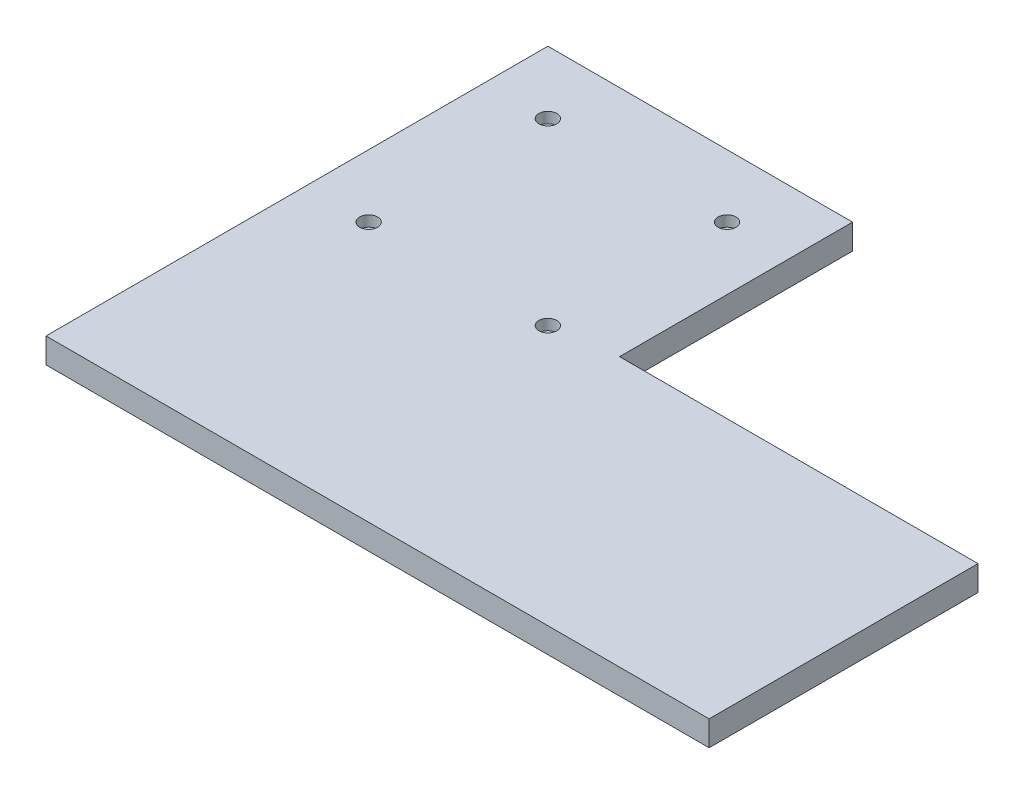
ISO-10303-21;
HEADER;
FILE_DESCRIPTION(('STEP AP214'),'2;1');
FILE_NAME('part.step','',(''),(''),'','','');
FILE_SCHEMA(('AUTOMOTIVE_DESIGN { 1 0 10303 214 1 1 1 1 }'));
ENDSEC;
DATA;
#1=APPLICATION_CONTEXT('core data for automotive mechanical design processes');
#2=APPLICATION_PROTOCOL_DEFINITION('international standard','automotive_design',2000,#1);
#3=PRODUCT_CONTEXT('',#1,'mechanical');
#4=PRODUCT('Part','Part','',(#3));
#5=PRODUCT_RELATED_PRODUCT_CATEGORY('part','',(#4));
#6=PRODUCT_DEFINITION_FORMATION('','',#4);
#7=PRODUCT_DEFINITION_CONTEXT('part definition',#1,'design');
#8=PRODUCT_DEFINITION('design','',#6,#7);
#9=PRODUCT_DEFINITION_SHAPE('','',#8);
#10=(LENGTH_UNIT() NAMED_UNIT(*) SI_UNIT(.MILLI.,.METRE.));
#11=(NAMED_UNIT(*) PLANE_ANGLE_UNIT() SI_UNIT($,.RADIAN.));
#12=(NAMED_UNIT(*) SI_UNIT($,.STERADIAN.) SOLID_ANGLE_UNIT());
#13=UNCERTAINTY_MEASURE_WITH_UNIT(LENGTH_MEASURE(1.E-05),#10,'distance_accuracy_value','');
#14=(GEOMETRIC_REPRESENTATION_CONTEXT(3) GLOBAL_UNCERTAINTY_ASSIGNED_CONTEXT((#13)) GLOBAL_UNIT_ASSIGNED_CONTEXT((#10,
#11,#12)) REPRESENTATION_CONTEXT('',''));
#15=CARTESIAN_POINT('',(0.,0.,0.));
#16=DIRECTION('',(0.,0.,1.));
#17=DIRECTION('',(1.,0.,0.));
#18=AXIS2_PLACEMENT_3D('',#15,#16,#17);
#19=CARTESIAN_POINT('',(0.,7.,0.));
#20=DIRECTION('',(0.,-1.,0.));
#21=DIRECTION('',(0.,0.,-1.));
#22=AXIS2_PLACEMENT_3D('',#19,#20,#21);
#23=PLANE('',#22);
#24=CARTESIAN_POINT('',(-3.18170640313416,7.,-14.3949044585987));
#25=DIRECTION('',(0.,1.,0.));
#26=DIRECTION('',(0.,0.,1.));
#27=AXIS2_PLACEMENT_3D('',#24,#25,#26);
#28=CIRCLE('',#27,2.49999999999999);
#29=CARTESIAN_POINT('',(-3.18170640313416,7.,-11.8949044585987));
#30=VERTEX_POINT('',#29);
#31=EDGE_CURVE('E239',#30,#30,#28,.T.);
#32=ORIENTED_EDGE('',*,*,#31,.F.);
#33=EDGE_LOOP('',(#32));
#34=FACE_BOUND('',#33,.T.);
#35=CARTESIAN_POINT('',(-53.1817064031342,7.,-14.3949044585987));
#36=DIRECTION('',(0.,1.,0.));
#37=DIRECTION('',(0.,0.,1.));
#38=AXIS2_PLACEMENT_3D('',#35,#36,#37);
#39=CIRCLE('',#38,2.49999999999999);
#40=CARTESIAN_POINT('',(-53.1817064031342,7.,-11.8949044585987));
#41=VERTEX_POINT('',#40);
#42=EDGE_CURVE('E223',#41,#41,#39,.T.);
#43=ORIENTED_EDGE('',*,*,#42,.F.);
#44=EDGE_LOOP('',(#43));
#45=FACE_BOUND('',#44,.T.);
#46=DIRECTION('',(-1.,0.,0.));
#47=VECTOR('',#46,1.);
#48=CARTESIAN_POINT('',(114.318293596866,7.,33.1050955414013));
#49=LINE('',#48,#47);
#50=CARTESIAN_POINT('',(114.318293596866,7.,33.1050955414013));
#51=VERTEX_POINT('',#50);
#52=CARTESIAN_POINT('',(14.3182935968658,7.,33.1050955414013));
#53=VERTEX_POINT('',#52);
#54=EDGE_CURVE('E146',#51,#53,#49,.T.);
#55=ORIENTED_EDGE('',*,*,#54,.T.);
#56=DIRECTION('',(0.,0.,-1.));
#57=VECTOR('',#56,1.);
#58=CARTESIAN_POINT('',(14.3182935968658,7.,33.1050955414013));
#59=LINE('',#58,#57);
#60=CARTESIAN_POINT('',(14.3182935968658,7.,-31.8949044585987));
#61=VERTEX_POINT('',#60);
#62=EDGE_CURVE('E94',#53,#61,#59,.T.);
#63=ORIENTED_EDGE('',*,*,#62,.T.);
#64=DIRECTION('',(-1.,0.,0.));
#65=VECTOR('',#64,1.);
#66=CARTESIAN_POINT('',(14.3182935968658,7.,-31.8949044585987));
#67=LINE('',#66,#65);
#68=CARTESIAN_POINT('',(-70.6817064031342,7.,-31.8949044585987));
#69=VERTEX_POINT('',#68);
#70=EDGE_CURVE('E107',#61,#69,#67,.T.);
#71=ORIENTED_EDGE('',*,*,#70,.T.);
#72=DIRECTION('',(0.,0.,1.));
#73=VECTOR('',#72,1.);
#74=CARTESIAN_POINT('',(-70.6817064031342,7.,-31.8949044585987));
#75=LINE('',#74,#73);
#76=CARTESIAN_POINT('',(-70.6817064031341,7.,108.105095541401));
#77=VERTEX_POINT('',#76);
#78=EDGE_CURVE('E101',#69,#77,#75,.T.);
#79=ORIENTED_EDGE('',*,*,#78,.T.);
#80=DIRECTION('',(1.,0.,0.));
#81=VECTOR('',#80,1.);
#82=CARTESIAN_POINT('',(-70.6817064031341,7.,108.105095541401));
#83=LINE('',#82,#81);
#84=CARTESIAN_POINT('',(114.318293596866,7.,108.105095541401));
#85=VERTEX_POINT('',#84);
#86=EDGE_CURVE('E105',#77,#85,#83,.T.);
#87=ORIENTED_EDGE('',*,*,#86,.T.);
#88=DIRECTION('',(0.,0.,-1.));
#89=VECTOR('',#88,1.);
#90=CARTESIAN_POINT('',(114.318293596866,7.,108.105095541401));
#91=LINE('',#90,#89);
#92=EDGE_CURVE('E57',#85,#51,#91,.T.);
#93=ORIENTED_EDGE('',*,*,#92,.T.);
#94=EDGE_LOOP('',(#55,#63,#71,#79,#87,#93));
#95=FACE_BOUND('',#94,.T.);
#96=CARTESIAN_POINT('',(-3.18170640313416,7.,35.6050955414013));
#97=DIRECTION('',(0.,-1.,0.));
#98=DIRECTION('',(0.,0.,-1.));
#99=AXIS2_PLACEMENT_3D('',#96,#97,#98);
#100=CIRCLE('',#99,2.49999999999999);
#101=CARTESIAN_POINT('',(-3.18170640313416,7.,33.1050955414013));
#102=VERTEX_POINT('',#101);
#103=EDGE_CURVE('E221',#102,#102,#100,.T.);
#104=ORIENTED_EDGE('',*,*,#103,.T.);
#105=EDGE_LOOP('',(#104));
#106=FACE_BOUND('',#105,.T.);
#107=CARTESIAN_POINT('',(-53.1817064031342,7.,35.6050955414013));
#108=DIRECTION('',(0.,-1.,0.));
#109=DIRECTION('',(0.,0.,-1.));
#110=AXIS2_PLACEMENT_3D('',#107,#108,#109);
#111=CIRCLE('',#110,2.49999999999999);
#112=CARTESIAN_POINT('',(-53.1817064031342,7.,33.1050955414013));
#113=VERTEX_POINT('',#112);
#114=EDGE_CURVE('E229',#113,#113,#111,.T.);
#115=ORIENTED_EDGE('',*,*,#114,.T.);
#116=EDGE_LOOP('',(#115));
#117=FACE_BOUND('',#116,.T.);
#118=ADVANCED_FACE('F39',(#34,#45,#95,#106,#117),#23,.F.);
#119=CARTESIAN_POINT('',(114.318293596866,7.,33.1050955414013));
#120=DIRECTION('',(0.,0.,1.));
#121=DIRECTION('',(1.,0.,0.));
#122=AXIS2_PLACEMENT_3D('',#119,#120,#121);
#123=PLANE('',#122);
#124=DIRECTION('',(-1.,0.,0.));
#125=VECTOR('',#124,1.);
#126=CARTESIAN_POINT('',(114.318293596866,0.,33.1050955414013));
#127=LINE('',#126,#125);
#128=CARTESIAN_POINT('',(114.318293596866,0.,33.1050955414013));
#129=VERTEX_POINT('',#128);
#130=CARTESIAN_POINT('',(14.3182935968658,0.,33.1050955414013));
#131=VERTEX_POINT('',#130);
#132=EDGE_CURVE('E129',#129,#131,#127,.T.);
#133=ORIENTED_EDGE('',*,*,#132,.T.);
#134=DIRECTION('',(0.,-1.,0.));
#135=VECTOR('',#134,1.);
#136=CARTESIAN_POINT('',(14.3182935968658,7.,33.1050955414013));
#137=LINE('',#136,#135);
#138=EDGE_CURVE('E11',#53,#131,#137,.T.);
#139=ORIENTED_EDGE('',*,*,#138,.F.);
#140=ORIENTED_EDGE('',*,*,#54,.F.);
#141=DIRECTION('',(0.,-1.,0.));
#142=VECTOR('',#141,1.);
#143=CARTESIAN_POINT('',(114.318293596866,7.,33.1050955414013));
#144=LINE('',#143,#142);
#145=EDGE_CURVE('E125',#51,#129,#144,.T.);
#146=ORIENTED_EDGE('',*,*,#145,.T.);
#147=EDGE_LOOP('',(#133,#139,#140,#146));
#148=FACE_BOUND('',#147,.T.);
#149=ADVANCED_FACE('F41',(#148),#123,.F.);
#150=CARTESIAN_POINT('',(14.3182935968658,7.,33.1050955414013));
#151=DIRECTION('',(-1.,0.,0.));
#152=DIRECTION('',(0.,0.,1.));
#153=AXIS2_PLACEMENT_3D('',#150,#151,#152);
#154=PLANE('',#153);
#155=DIRECTION('',(0.,0.,-1.));
#156=VECTOR('',#155,1.);
#157=CARTESIAN_POINT('',(14.3182935968658,0.,33.1050955414013));
#158=LINE('',#157,#156);
#159=CARTESIAN_POINT('',(14.3182935968658,0.,-31.8949044585987));
#160=VERTEX_POINT('',#159);
#161=EDGE_CURVE('E133',#131,#160,#158,.T.);
#162=ORIENTED_EDGE('',*,*,#161,.T.);
#163=DIRECTION('',(0.,-1.,0.));
#164=VECTOR('',#163,1.);
#165=CARTESIAN_POINT('',(14.3182935968658,7.,-31.8949044585987));
#166=LINE('',#165,#164);
#167=EDGE_CURVE('E49',#61,#160,#166,.T.);
#168=ORIENTED_EDGE('',*,*,#167,.F.);
#169=ORIENTED_EDGE('',*,*,#62,.F.);
#170=ORIENTED_EDGE('',*,*,#138,.T.);
#171=EDGE_LOOP('',(#162,#168,#169,#170));
#172=FACE_BOUND('',#171,.T.);
#173=ADVANCED_FACE('F179',(#172),#154,.F.);
#174=CARTESIAN_POINT('',(14.3182935968658,7.,-31.8949044585987));
#175=DIRECTION('',(0.,0.,1.));
#176=DIRECTION('',(1.,0.,0.));
#177=AXIS2_PLACEMENT_3D('',#174,#175,#176);
#178=PLANE('',#177);
#179=DIRECTION('',(-1.,0.,0.));
#180=VECTOR('',#179,1.);
#181=CARTESIAN_POINT('',(14.3182935968658,0.,-31.8949044585987));
#182=LINE('',#181,#180);
#183=CARTESIAN_POINT('',(-70.6817064031342,0.,-31.8949044585987));
#184=VERTEX_POINT('',#183);
#185=EDGE_CURVE('E137',#160,#184,#182,.T.);
#186=ORIENTED_EDGE('',*,*,#185,.T.);
#187=DIRECTION('',(0.,-1.,0.));
#188=VECTOR('',#187,1.);
#189=CARTESIAN_POINT('',(-70.6817064031342,7.,-31.8949044585987));
#190=LINE('',#189,#188);
#191=EDGE_CURVE('E118',#69,#184,#190,.T.);
#192=ORIENTED_EDGE('',*,*,#191,.F.);
#193=ORIENTED_EDGE('',*,*,#70,.F.);
#194=ORIENTED_EDGE('',*,*,#167,.T.);
#195=EDGE_LOOP('',(#186,#192,#193,#194));
#196=FACE_BOUND('',#195,.T.);
#197=ADVANCED_FACE('F156',(#196),#178,.F.);
#198=CARTESIAN_POINT('',(-70.6817064031342,7.,-31.8949044585987));
#199=DIRECTION('',(1.,0.,0.));
#200=DIRECTION('',(0.,0.,-1.));
#201=AXIS2_PLACEMENT_3D('',#198,#199,#200);
#202=PLANE('',#201);
#203=DIRECTION('',(0.,0.,1.));
#204=VECTOR('',#203,1.);
#205=CARTESIAN_POINT('',(-70.6817064031342,0.,-31.8949044585987));
#206=LINE('',#205,#204);
#207=CARTESIAN_POINT('',(-70.6817064031341,0.,108.105095541401));
#208=VERTEX_POINT('',#207);
#209=EDGE_CURVE('E116',#184,#208,#206,.T.);
#210=ORIENTED_EDGE('',*,*,#209,.T.);
#211=DIRECTION('',(0.,-1.,0.));
#212=VECTOR('',#211,1.);
#213=CARTESIAN_POINT('',(-70.6817064031341,7.,108.105095541401));
#214=LINE('',#213,#212);
#215=EDGE_CURVE('E113',#77,#208,#214,.T.);
#216=ORIENTED_EDGE('',*,*,#215,.F.);
#217=ORIENTED_EDGE('',*,*,#78,.F.);
#218=ORIENTED_EDGE('',*,*,#191,.T.);
#219=EDGE_LOOP('',(#210,#216,#217,#218));
#220=FACE_BOUND('',#219,.T.);
#221=ADVANCED_FACE('F114',(#220),#202,.F.);
#222=CARTESIAN_POINT('',(-70.6817064031341,7.,108.105095541401));
#223=DIRECTION('',(0.,0.,-1.));
#224=DIRECTION('',(-1.,0.,0.));
#225=AXIS2_PLACEMENT_3D('',#222,#223,#224);
#226=PLANE('',#225);
#227=DIRECTION('',(1.,0.,0.));
#228=VECTOR('',#227,1.);
#229=CARTESIAN_POINT('',(-70.6817064031341,0.,108.105095541401));
#230=LINE('',#229,#228);
#231=CARTESIAN_POINT('',(114.318293596866,0.,108.105095541401));
#232=VERTEX_POINT('',#231);
#233=EDGE_CURVE('E80',#208,#232,#230,.T.);
#234=ORIENTED_EDGE('',*,*,#233,.T.);
#235=DIRECTION('',(0.,-1.,0.));
#236=VECTOR('',#235,1.);
#237=CARTESIAN_POINT('',(114.318293596866,7.,108.105095541401));
#238=LINE('',#237,#236);
#239=EDGE_CURVE('E119',#85,#232,#238,.T.);
#240=ORIENTED_EDGE('',*,*,#239,.F.);
#241=ORIENTED_EDGE('',*,*,#86,.F.);
#242=ORIENTED_EDGE('',*,*,#215,.T.);
#243=EDGE_LOOP('',(#234,#240,#241,#242));
#244=FACE_BOUND('',#243,.T.);
#245=ADVANCED_FACE('F121',(#244),#226,.F.);
#246=CARTESIAN_POINT('',(114.318293596866,7.,108.105095541401));
#247=DIRECTION('',(-1.,0.,0.));
#248=DIRECTION('',(0.,0.,1.));
#249=AXIS2_PLACEMENT_3D('',#246,#247,#248);
#250=PLANE('',#249);
#251=DIRECTION('',(0.,0.,-1.));
#252=VECTOR('',#251,1.);
#253=CARTESIAN_POINT('',(114.318293596866,0.,108.105095541401));
#254=LINE('',#253,#252);
#255=EDGE_CURVE('E86',#232,#129,#254,.T.);
#256=ORIENTED_EDGE('',*,*,#255,.T.);
#257=ORIENTED_EDGE('',*,*,#145,.F.);
#258=ORIENTED_EDGE('',*,*,#92,.F.);
#259=ORIENTED_EDGE('',*,*,#239,.T.);
#260=EDGE_LOOP('',(#256,#257,#258,#259));
#261=FACE_BOUND('',#260,.T.);
#262=ADVANCED_FACE('F163',(#261),#250,.F.);
#263=CARTESIAN_POINT('',(0.,0.,0.));
#264=DIRECTION('',(0.,-1.,0.));
#265=DIRECTION('',(0.,0.,-1.));
#266=AXIS2_PLACEMENT_3D('',#263,#264,#265);
#267=PLANE('',#266);
#268=ORIENTED_EDGE('',*,*,#132,.F.);
#269=ORIENTED_EDGE('',*,*,#255,.F.);
#270=ORIENTED_EDGE('',*,*,#233,.F.);
#271=ORIENTED_EDGE('',*,*,#209,.F.);
#272=ORIENTED_EDGE('',*,*,#185,.F.);
#273=ORIENTED_EDGE('',*,*,#161,.F.);
#274=EDGE_LOOP('',(#268,#269,#270,#271,#272,#273));
#275=FACE_BOUND('',#274,.T.);
#276=ADVANCED_FACE('F159',(#275),#267,.T.);
#277=CARTESIAN_POINT('',(-53.1817064031342,4.,-14.3949044585987));
#278=DIRECTION('',(0.,1.,0.));
#279=DIRECTION('',(0.,0.,1.));
#280=AXIS2_PLACEMENT_3D('',#277,#278,#279);
#281=CYLINDRICAL_SURFACE('',#280,2.49999999999999);
#282=CARTESIAN_POINT('',(-53.1817064031342,4.,-14.3949044585987));
#283=DIRECTION('',(0.,1.,0.));
#284=DIRECTION('',(0.,0.,1.));
#285=AXIS2_PLACEMENT_3D('',#282,#283,#284);
#286=CIRCLE('',#285,2.49999999999999);
#287=CARTESIAN_POINT('',(-53.1817064031342,4.,-11.8949044585987));
#288=VERTEX_POINT('',#287);
#289=EDGE_CURVE('E134',#288,#288,#286,.T.);
#290=ORIENTED_EDGE('',*,*,#289,.F.);
#291=EDGE_LOOP('',(#290));
#292=FACE_BOUND('',#291,.T.);
#293=ORIENTED_EDGE('',*,*,#42,.T.);
#294=EDGE_LOOP('',(#293));
#295=FACE_BOUND('',#294,.T.);
#296=ADVANCED_FACE('F170',(#292,#295),#281,.F.);
#297=CARTESIAN_POINT('',(-53.1817064031342,4.,-14.3949044585987));
#298=DIRECTION('',(0.,1.,0.));
#299=DIRECTION('',(0.,0.,1.));
#300=AXIS2_PLACEMENT_3D('',#297,#298,#299);
#301=PLANE('',#300);
#302=ORIENTED_EDGE('',*,*,#289,.T.);
#303=EDGE_LOOP('',(#302));
#304=FACE_BOUND('',#303,.T.);
#305=ADVANCED_FACE('F185',(#304),#301,.T.);
#306=CARTESIAN_POINT('',(-3.18170640313416,4.,35.6050955414013));
#307=DIRECTION('',(0.,1.,0.));
#308=DIRECTION('',(0.,0.,1.));
#309=AXIS2_PLACEMENT_3D('',#306,#307,#308);
#310=CYLINDRICAL_SURFACE('',#309,2.49999999999999);
#311=CARTESIAN_POINT('',(-3.18170640313416,4.,35.6050955414013));
#312=DIRECTION('',(0.,-1.,0.));
#313=DIRECTION('',(0.,0.,-1.));
#314=AXIS2_PLACEMENT_3D('',#311,#312,#313);
#315=CIRCLE('',#314,2.49999999999999);
#316=CARTESIAN_POINT('',(-3.18170640313416,4.,33.1050955414013));
#317=VERTEX_POINT('',#316);
#318=EDGE_CURVE('E218',#317,#317,#315,.T.);
#319=ORIENTED_EDGE('',*,*,#318,.T.);
#320=EDGE_LOOP('',(#319));
#321=FACE_BOUND('',#320,.T.);
#322=ORIENTED_EDGE('',*,*,#103,.F.);
#323=EDGE_LOOP('',(#322));
#324=FACE_BOUND('',#323,.T.);
#325=ADVANCED_FACE('F189',(#321,#324),#310,.F.);
#326=CARTESIAN_POINT('',(-3.18170640313416,4.,35.6050955414013));
#327=DIRECTION('',(0.,-1.,0.));
#328=DIRECTION('',(0.,0.,-1.));
#329=AXIS2_PLACEMENT_3D('',#326,#327,#328);
#330=PLANE('',#329);
#331=ORIENTED_EDGE('',*,*,#318,.F.);
#332=EDGE_LOOP('',(#331));
#333=FACE_BOUND('',#332,.T.);
#334=ADVANCED_FACE('F206',(#333),#330,.F.);
#335=CARTESIAN_POINT('',(-53.1817064031342,4.,35.6050955414013));
#336=DIRECTION('',(0.,1.,0.));
#337=DIRECTION('',(0.,0.,1.));
#338=AXIS2_PLACEMENT_3D('',#335,#336,#337);
#339=CYLINDRICAL_SURFACE('',#338,2.49999999999999);
#340=CARTESIAN_POINT('',(-53.1817064031342,4.,35.6050955414013));
#341=DIRECTION('',(0.,-1.,0.));
#342=DIRECTION('',(0.,0.,-1.));
#343=AXIS2_PLACEMENT_3D('',#340,#341,#342);
#344=CIRCLE('',#343,2.49999999999999);
#345=CARTESIAN_POINT('',(-53.1817064031342,4.,33.1050955414013));
#346=VERTEX_POINT('',#345);
#347=EDGE_CURVE('E235',#346,#346,#344,.T.);
#348=ORIENTED_EDGE('',*,*,#347,.T.);
#349=EDGE_LOOP('',(#348));
#350=FACE_BOUND('',#349,.T.);
#351=ORIENTED_EDGE('',*,*,#114,.F.);
#352=EDGE_LOOP('',(#351));
#353=FACE_BOUND('',#352,.T.);
#354=ADVANCED_FACE('F202',(#350,#353),#339,.F.);
#355=CARTESIAN_POINT('',(-53.1817064031342,4.,35.6050955414013));
#356=DIRECTION('',(0.,-1.,0.));
#357=DIRECTION('',(0.,0.,-1.));
#358=AXIS2_PLACEMENT_3D('',#355,#356,#357);
#359=PLANE('',#358);
#360=ORIENTED_EDGE('',*,*,#347,.F.);
#361=EDGE_LOOP('',(#360));
#362=FACE_BOUND('',#361,.T.);
#363=ADVANCED_FACE('F198',(#362),#359,.F.);
#364=CARTESIAN_POINT('',(-3.18170640313416,4.,-14.3949044585987));
#365=DIRECTION('',(0.,1.,0.));
#366=DIRECTION('',(0.,0.,1.));
#367=AXIS2_PLACEMENT_3D('',#364,#365,#366);
#368=CYLINDRICAL_SURFACE('',#367,2.49999999999999);
#369=CARTESIAN_POINT('',(-3.18170640313416,4.,-14.3949044585987));
#370=DIRECTION('',(0.,1.,0.));
#371=DIRECTION('',(0.,0.,1.));
#372=AXIS2_PLACEMENT_3D('',#369,#370,#371);
#373=CIRCLE('',#372,2.49999999999999);
#374=CARTESIAN_POINT('',(-3.18170640313416,4.,-11.8949044585987));
#375=VERTEX_POINT('',#374);
#376=EDGE_CURVE('E243',#375,#375,#373,.T.);
#377=ORIENTED_EDGE('',*,*,#376,.F.);
#378=EDGE_LOOP('',(#377));
#379=FACE_BOUND('',#378,.T.);
#380=ORIENTED_EDGE('',*,*,#31,.T.);
#381=EDGE_LOOP('',(#380));
#382=FACE_BOUND('',#381,.T.);
#383=ADVANCED_FACE('F194',(#379,#382),#368,.F.);
#384=CARTESIAN_POINT('',(-3.18170640313416,4.,-14.3949044585987));
#385=DIRECTION('',(0.,1.,0.));
#386=DIRECTION('',(0.,0.,1.));
#387=AXIS2_PLACEMENT_3D('',#384,#385,#386);
#388=PLANE('',#387);
#389=ORIENTED_EDGE('',*,*,#376,.T.);
#390=EDGE_LOOP('',(#389));
#391=FACE_BOUND('',#390,.T.);
#392=ADVANCED_FACE('F191',(#391),#388,.T.);
#393=CLOSED_SHELL('',(#118,#149,#173,#197,#221,#245,#262,#276,#296,#305,#325,#334,#354,#363,
#383,#392));
#394=MANIFOLD_SOLID_BREP('B2',#393);
#395=ADVANCED_BREP_SHAPE_REPRESENTATION('',(#18,#394),#14);
#396=SHAPE_DEFINITION_REPRESENTATION(#9,#395);
ENDSEC;
END-ISO-10303-21;
